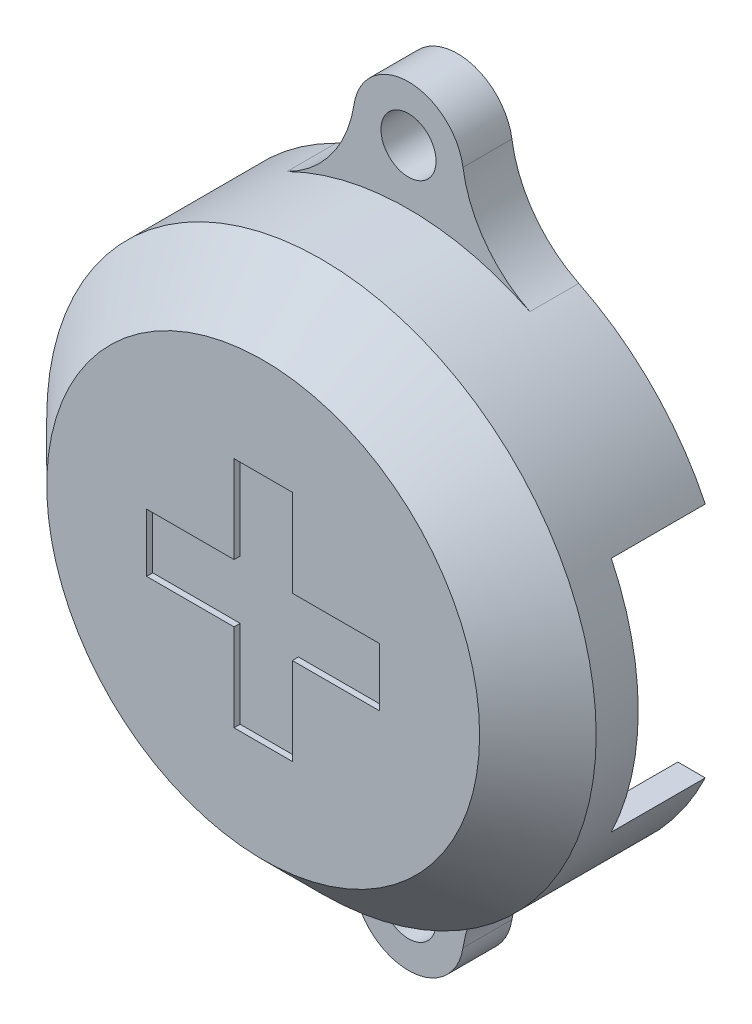
ISO-10303-21;
HEADER;
FILE_DESCRIPTION(('STEP AP214'),'2;1');
FILE_NAME('part.step','',(''),(''),'','','');
FILE_SCHEMA(('AUTOMOTIVE_DESIGN { 1 0 10303 214 1 1 1 1 }'));
ENDSEC;
DATA;
#1=APPLICATION_CONTEXT('core data for automotive mechanical design processes');
#2=APPLICATION_PROTOCOL_DEFINITION('international standard','automotive_design',2000,#1);
#3=PRODUCT_CONTEXT('',#1,'mechanical');
#4=PRODUCT('Part','Part','',(#3));
#5=PRODUCT_RELATED_PRODUCT_CATEGORY('part','',(#4));
#6=PRODUCT_DEFINITION_FORMATION('','',#4);
#7=PRODUCT_DEFINITION_CONTEXT('part definition',#1,'design');
#8=PRODUCT_DEFINITION('design','',#6,#7);
#9=PRODUCT_DEFINITION_SHAPE('','',#8);
#10=(LENGTH_UNIT() NAMED_UNIT(*) SI_UNIT(.MILLI.,.METRE.));
#11=(NAMED_UNIT(*) PLANE_ANGLE_UNIT() SI_UNIT($,.RADIAN.));
#12=(NAMED_UNIT(*) SI_UNIT($,.STERADIAN.) SOLID_ANGLE_UNIT());
#13=UNCERTAINTY_MEASURE_WITH_UNIT(LENGTH_MEASURE(1.E-05),#10,'distance_accuracy_value','');
#14=(GEOMETRIC_REPRESENTATION_CONTEXT(3) GLOBAL_UNCERTAINTY_ASSIGNED_CONTEXT((#13)) GLOBAL_UNIT_ASSIGNED_CONTEXT((#10,
#11,#12)) REPRESENTATION_CONTEXT('',''));
#15=CARTESIAN_POINT('',(0.,0.,0.));
#16=DIRECTION('',(0.,0.,1.));
#17=DIRECTION('',(1.,0.,0.));
#18=AXIS2_PLACEMENT_3D('',#15,#16,#17);
#19=CARTESIAN_POINT('',(0.,0.,0.));
#20=DIRECTION('',(0.,0.,1.));
#21=DIRECTION('',(1.,0.,0.));
#22=AXIS2_PLACEMENT_3D('',#19,#20,#21);
#23=PLANE('',#22);
#24=CARTESIAN_POINT('',(-1.38777878078145E-13,-26.9500000000001,0.));
#25=DIRECTION('',(0.,0.,1.));
#26=DIRECTION('',(1.,0.,0.));
#27=AXIS2_PLACEMENT_3D('',#24,#25,#26);
#28=CIRCLE('',#27,2.25);
#29=CARTESIAN_POINT('',(2.24999999999986,-26.9500000000001,0.));
#30=VERTEX_POINT('',#29);
#31=EDGE_CURVE('E317',#30,#30,#28,.T.);
#32=ORIENTED_EDGE('',*,*,#31,.T.);
#33=EDGE_LOOP('',(#32));
#34=FACE_BOUND('',#33,.T.);
#35=CARTESIAN_POINT('',(3.89761872857662E-13,-2.24526230456904E-11,0.));
#36=DIRECTION('',(0.,0.,1.));
#37=DIRECTION('',(1.,0.,0.));
#38=AXIS2_PLACEMENT_3D('',#35,#36,#37);
#39=CIRCLE('',#38,22.45);
#40=CARTESIAN_POINT('',(-20.2515623828316,-9.68900000282286,0.));
#41=VERTEX_POINT('',#40);
#42=CARTESIAN_POINT('',(-9.9196082532722,-20.139609532027,0.));
#43=VERTEX_POINT('',#42);
#44=EDGE_CURVE('E258',#41,#43,#39,.T.);
#45=ORIENTED_EDGE('',*,*,#44,.F.);
#46=DIRECTION('',(1.,0.,0.));
#47=VECTOR('',#46,1.);
#48=CARTESIAN_POINT('',(-22.4499999999996,-9.68900000282286,0.));
#49=LINE('',#48,#47);
#50=CARTESIAN_POINT('',(-18.0090471415264,-9.68900000282286,0.));
#51=VERTEX_POINT('',#50);
#52=EDGE_CURVE('E747',#41,#51,#49,.T.);
#53=ORIENTED_EDGE('',*,*,#52,.T.);
#54=CARTESIAN_POINT('',(3.89761872857662E-13,-2.24526230456904E-11,0.));
#55=DIRECTION('',(0.,0.,1.));
#56=DIRECTION('',(1.,0.,0.));
#57=AXIS2_PLACEMENT_3D('',#54,#55,#56);
#58=CIRCLE('',#57,20.45);
#59=CARTESIAN_POINT('',(18.0090471415272,-9.68900000282286,0.));
#60=VERTEX_POINT('',#59);
#61=EDGE_CURVE('E305',#51,#60,#58,.T.);
#62=ORIENTED_EDGE('',*,*,#61,.T.);
#63=CARTESIAN_POINT('',(20.2515623828323,-9.68900000282286,0.));
#64=VERTEX_POINT('',#63);
#65=EDGE_CURVE('E745',#60,#64,#49,.T.);
#66=ORIENTED_EDGE('',*,*,#65,.T.);
#67=CARTESIAN_POINT('',(3.89761872857662E-13,-2.24526230456904E-11,0.));
#68=DIRECTION('',(0.,0.,1.));
#69=DIRECTION('',(1.,0.,0.));
#70=AXIS2_PLACEMENT_3D('',#67,#68,#69);
#71=CIRCLE('',#70,22.45);
#72=CARTESIAN_POINT('',(9.91960825327326,-20.1396095320268,0.));
#73=VERTEX_POINT('',#72);
#74=EDGE_CURVE('E354',#73,#64,#71,.T.);
#75=ORIENTED_EDGE('',*,*,#74,.F.);
#76=CARTESIAN_POINT('',(14.3381419963792,-29.1104823747905,0.));
#77=DIRECTION('',(0.,0.,1.));
#78=DIRECTION('',(1.,0.,0.));
#79=AXIS2_PLACEMENT_3D('',#76,#77,#78);
#80=CIRCLE('',#79,10.);
#81=CARTESIAN_POINT('',(4.44976820577325,-27.6204945301229,0.));
#82=VERTEX_POINT('',#81);
#83=EDGE_CURVE('E350',#73,#82,#80,.T.);
#84=ORIENTED_EDGE('',*,*,#83,.T.);
#85=CARTESIAN_POINT('',(5.67110933929236E-13,-26.9500000000225,0.));
#86=DIRECTION('',(0.,0.,1.));
#87=DIRECTION('',(1.,0.,0.));
#88=AXIS2_PLACEMENT_3D('',#85,#86,#87);
#89=CIRCLE('',#88,4.5);
#90=CARTESIAN_POINT('',(-4.44976820577211,-27.6204945301229,0.));
#91=VERTEX_POINT('',#90);
#92=EDGE_CURVE('E347',#91,#82,#89,.T.);
#93=ORIENTED_EDGE('',*,*,#92,.F.);
#94=CARTESIAN_POINT('',(-14.338141996378,-29.1104823747906,0.));
#95=DIRECTION('',(0.,0.,1.));
#96=DIRECTION('',(1.,0.,0.));
#97=AXIS2_PLACEMENT_3D('',#94,#95,#96);
#98=CIRCLE('',#97,9.99999999999999);
#99=EDGE_CURVE('E337',#91,#43,#98,.T.);
#100=ORIENTED_EDGE('',*,*,#99,.T.);
#101=EDGE_LOOP('',(#45,#53,#62,#66,#75,#84,#93,#100));
#102=FACE_BOUND('',#101,.T.);
#103=ADVANCED_FACE('F46',(#34,#102),#23,.F.);
#104=CARTESIAN_POINT('',(0.,0.,15.875));
#105=DIRECTION('',(0.,0.,1.));
#106=DIRECTION('',(1.,0.,0.));
#107=AXIS2_PLACEMENT_3D('',#104,#105,#106);
#108=PLANE('',#107);
#109=CARTESIAN_POINT('',(3.89761872857662E-13,-2.24526230456904E-11,15.875));
#110=DIRECTION('',(0.,0.,1.));
#111=DIRECTION('',(1.,0.,0.));
#112=AXIS2_PLACEMENT_3D('',#109,#110,#111);
#113=CIRCLE('',#112,17.6875);
#114=CARTESIAN_POINT('',(17.6875000000004,-2.24526230456904E-11,15.875));
#115=VERTEX_POINT('',#114);
#116=EDGE_CURVE('E280',#115,#115,#113,.T.);
#117=ORIENTED_EDGE('',*,*,#116,.T.);
#118=EDGE_LOOP('',(#117));
#119=FACE_BOUND('',#118,.T.);
#120=DIRECTION('',(1.,0.,0.));
#121=VECTOR('',#120,1.);
#122=CARTESIAN_POINT('',(0.,9.525,15.875));
#123=LINE('',#122,#121);
#124=CARTESIAN_POINT('',(-2.38125,9.525,15.875));
#125=VERTEX_POINT('',#124);
#126=CARTESIAN_POINT('',(2.38125,9.525,15.875));
#127=VERTEX_POINT('',#126);
#128=EDGE_CURVE('E425',#125,#127,#123,.T.);
#129=ORIENTED_EDGE('',*,*,#128,.T.);
#130=DIRECTION('',(0.,-1.,0.));
#131=VECTOR('',#130,1.);
#132=CARTESIAN_POINT('',(2.38125,0.,15.875));
#133=LINE('',#132,#131);
#134=CARTESIAN_POINT('',(2.38125,2.38125,15.875));
#135=VERTEX_POINT('',#134);
#136=EDGE_CURVE('E389',#127,#135,#133,.T.);
#137=ORIENTED_EDGE('',*,*,#136,.T.);
#138=DIRECTION('',(1.,0.,0.));
#139=VECTOR('',#138,1.);
#140=CARTESIAN_POINT('',(0.,2.38125,15.875));
#141=LINE('',#140,#139);
#142=CARTESIAN_POINT('',(9.525,2.38125,15.875));
#143=VERTEX_POINT('',#142);
#144=EDGE_CURVE('E394',#135,#143,#141,.T.);
#145=ORIENTED_EDGE('',*,*,#144,.T.);
#146=DIRECTION('',(0.,-1.,0.));
#147=VECTOR('',#146,1.);
#148=CARTESIAN_POINT('',(9.525,0.,15.875));
#149=LINE('',#148,#147);
#150=CARTESIAN_POINT('',(9.525,-2.38125,15.875));
#151=VERTEX_POINT('',#150);
#152=EDGE_CURVE('E452',#143,#151,#149,.T.);
#153=ORIENTED_EDGE('',*,*,#152,.T.);
#154=DIRECTION('',(1.,0.,0.));
#155=VECTOR('',#154,1.);
#156=CARTESIAN_POINT('',(0.,-2.38125,15.875));
#157=LINE('',#156,#155);
#158=CARTESIAN_POINT('',(2.38125,-2.38125,15.875));
#159=VERTEX_POINT('',#158);
#160=EDGE_CURVE('E449',#159,#151,#157,.T.);
#161=ORIENTED_EDGE('',*,*,#160,.F.);
#162=DIRECTION('',(0.,-1.,0.));
#163=VECTOR('',#162,1.);
#164=CARTESIAN_POINT('',(2.38125,0.,15.875));
#165=LINE('',#164,#163);
#166=CARTESIAN_POINT('',(2.38125,-9.525,15.875));
#167=VERTEX_POINT('',#166);
#168=EDGE_CURVE('E446',#159,#167,#165,.T.);
#169=ORIENTED_EDGE('',*,*,#168,.T.);
#170=DIRECTION('',(1.,0.,0.));
#171=VECTOR('',#170,1.);
#172=CARTESIAN_POINT('',(0.,-9.525,15.875));
#173=LINE('',#172,#171);
#174=CARTESIAN_POINT('',(-2.38125,-9.525,15.875));
#175=VERTEX_POINT('',#174);
#176=EDGE_CURVE('E443',#175,#167,#173,.T.);
#177=ORIENTED_EDGE('',*,*,#176,.F.);
#178=DIRECTION('',(0.,-1.,0.));
#179=VECTOR('',#178,1.);
#180=CARTESIAN_POINT('',(-2.38125,0.,15.875));
#181=LINE('',#180,#179);
#182=CARTESIAN_POINT('',(-2.38125,-2.38125,15.875));
#183=VERTEX_POINT('',#182);
#184=EDGE_CURVE('E440',#183,#175,#181,.T.);
#185=ORIENTED_EDGE('',*,*,#184,.F.);
#186=DIRECTION('',(1.,0.,0.));
#187=VECTOR('',#186,1.);
#188=CARTESIAN_POINT('',(0.,-2.38125,15.875));
#189=LINE('',#188,#187);
#190=CARTESIAN_POINT('',(-9.525,-2.38125,15.875));
#191=VERTEX_POINT('',#190);
#192=EDGE_CURVE('E437',#191,#183,#189,.T.);
#193=ORIENTED_EDGE('',*,*,#192,.F.);
#194=DIRECTION('',(0.,-1.,0.));
#195=VECTOR('',#194,1.);
#196=CARTESIAN_POINT('',(-9.525,0.,15.875));
#197=LINE('',#196,#195);
#198=CARTESIAN_POINT('',(-9.525,2.38125,15.875));
#199=VERTEX_POINT('',#198);
#200=EDGE_CURVE('E434',#199,#191,#197,.T.);
#201=ORIENTED_EDGE('',*,*,#200,.F.);
#202=DIRECTION('',(1.,0.,0.));
#203=VECTOR('',#202,1.);
#204=CARTESIAN_POINT('',(0.,2.38125,15.875));
#205=LINE('',#204,#203);
#206=CARTESIAN_POINT('',(-2.38125,2.38125,15.875));
#207=VERTEX_POINT('',#206);
#208=EDGE_CURVE('E431',#199,#207,#205,.T.);
#209=ORIENTED_EDGE('',*,*,#208,.T.);
#210=DIRECTION('',(0.,-1.,0.));
#211=VECTOR('',#210,1.);
#212=CARTESIAN_POINT('',(-2.38125,0.,15.875));
#213=LINE('',#212,#211);
#214=EDGE_CURVE('E428',#125,#207,#213,.T.);
#215=ORIENTED_EDGE('',*,*,#214,.F.);
#216=EDGE_LOOP('',(#129,#137,#145,#153,#161,#169,#177,#185,#193,#201,#209,#215));
#217=FACE_BOUND('',#216,.T.);
#218=ADVANCED_FACE('F497',(#119,#217),#108,.T.);
#219=CARTESIAN_POINT('',(20.2515623855119,9.68899999717713,0.));
#220=VERTEX_POINT('',#219);
#221=CARTESIAN_POINT('',(9.91960825327298,20.139609531982,0.));
#222=VERTEX_POINT('',#221);
#223=EDGE_CURVE('E353',#220,#222,#71,.T.);
#224=ORIENTED_EDGE('',*,*,#223,.F.);
#225=DIRECTION('',(1.,0.,0.));
#226=VECTOR('',#225,1.);
#227=CARTESIAN_POINT('',(-22.4499999999996,9.68899999717713,0.));
#228=LINE('',#227,#226);
#229=CARTESIAN_POINT('',(18.0090471445405,9.68899999717713,0.));
#230=VERTEX_POINT('',#229);
#231=EDGE_CURVE('E252',#230,#220,#228,.T.);
#232=ORIENTED_EDGE('',*,*,#231,.F.);
#233=CARTESIAN_POINT('',(-18.0090471445397,9.68899999717713,0.));
#234=VERTEX_POINT('',#233);
#235=EDGE_CURVE('E251',#230,#234,#58,.T.);
#236=ORIENTED_EDGE('',*,*,#235,.T.);
#237=CARTESIAN_POINT('',(-20.2515623855112,9.68899999717713,0.));
#238=VERTEX_POINT('',#237);
#239=EDGE_CURVE('E70',#238,#234,#228,.T.);
#240=ORIENTED_EDGE('',*,*,#239,.F.);
#241=CARTESIAN_POINT('',(-9.91960825327249,20.1396095319819,0.));
#242=VERTEX_POINT('',#241);
#243=EDGE_CURVE('E247',#242,#238,#39,.T.);
#244=ORIENTED_EDGE('',*,*,#243,.F.);
#245=CARTESIAN_POINT('',(-14.3381419963784,29.1104823747455,0.));
#246=DIRECTION('',(0.,0.,1.));
#247=DIRECTION('',(1.,0.,0.));
#248=AXIS2_PLACEMENT_3D('',#245,#246,#247);
#249=CIRCLE('',#248,10.);
#250=CARTESIAN_POINT('',(-4.44976820577248,27.620494530078,0.));
#251=VERTEX_POINT('',#250);
#252=EDGE_CURVE('E262',#242,#251,#249,.T.);
#253=ORIENTED_EDGE('',*,*,#252,.T.);
#254=CARTESIAN_POINT('',(1.99088654611365E-13,26.9499999999776,0.));
#255=DIRECTION('',(0.,0.,1.));
#256=DIRECTION('',(1.,0.,0.));
#257=AXIS2_PLACEMENT_3D('',#254,#255,#256);
#258=CIRCLE('',#257,4.5);
#259=CARTESIAN_POINT('',(4.44976820577287,27.620494530078,0.));
#260=VERTEX_POINT('',#259);
#261=EDGE_CURVE('E359',#260,#251,#258,.T.);
#262=ORIENTED_EDGE('',*,*,#261,.F.);
#263=CARTESIAN_POINT('',(14.3381419963788,29.1104823747457,0.));
#264=DIRECTION('',(0.,0.,1.));
#265=DIRECTION('',(1.,0.,0.));
#266=AXIS2_PLACEMENT_3D('',#263,#264,#265);
#267=CIRCLE('',#266,10.);
#268=EDGE_CURVE('E357',#260,#222,#267,.T.);
#269=ORIENTED_EDGE('',*,*,#268,.T.);
#270=EDGE_LOOP('',(#224,#232,#236,#240,#244,#253,#262,#269));
#271=FACE_BOUND('',#270,.T.);
#272=CARTESIAN_POINT('',(1.99088654611365E-13,26.9499999999776,0.));
#273=DIRECTION('',(0.,0.,1.));
#274=DIRECTION('',(1.,0.,0.));
#275=AXIS2_PLACEMENT_3D('',#272,#273,#274);
#276=CIRCLE('',#275,2.25);
#277=CARTESIAN_POINT('',(2.2500000000002,26.9499999999776,0.));
#278=VERTEX_POINT('',#277);
#279=EDGE_CURVE('E323',#278,#278,#276,.T.);
#280=ORIENTED_EDGE('',*,*,#279,.T.);
#281=EDGE_LOOP('',(#280));
#282=FACE_BOUND('',#281,.T.);
#283=ADVANCED_FACE('F244',(#271,#282),#23,.F.);
#284=CARTESIAN_POINT('',(-14.338141996378,-29.1104823747906,15.875));
#285=DIRECTION('',(0.,0.,-1.));
#286=DIRECTION('',(-1.,0.,0.));
#287=AXIS2_PLACEMENT_3D('',#284,#285,#286);
#288=CYLINDRICAL_SURFACE('',#287,9.99999999999999);
#289=DIRECTION('',(0.,0.,-1.));
#290=VECTOR('',#289,1.);
#291=CARTESIAN_POINT('',(-4.44976820577211,-27.6204945301229,15.875));
#292=LINE('',#291,#290);
#293=CARTESIAN_POINT('',(-4.44976820577211,-27.6204945301229,4.));
#294=VERTEX_POINT('',#293);
#295=EDGE_CURVE('E278',#294,#91,#292,.T.);
#296=ORIENTED_EDGE('',*,*,#295,.F.);
#297=CARTESIAN_POINT('',(-14.338141996378,-29.1104823747906,4.));
#298=DIRECTION('',(0.,0.,1.));
#299=DIRECTION('',(1.,0.,0.));
#300=AXIS2_PLACEMENT_3D('',#297,#298,#299);
#301=CIRCLE('',#300,9.99999999999999);
#302=CARTESIAN_POINT('',(-9.9196082532722,-20.139609532027,4.));
#303=VERTEX_POINT('',#302);
#304=EDGE_CURVE('E329',#303,#294,#301,.F.);
#305=ORIENTED_EDGE('',*,*,#304,.F.);
#306=DIRECTION('',(0.,0.,-1.));
#307=VECTOR('',#306,1.);
#308=CARTESIAN_POINT('',(-9.9196082532722,-20.139609532027,15.875));
#309=LINE('',#308,#307);
#310=EDGE_CURVE('E257',#303,#43,#309,.T.);
#311=ORIENTED_EDGE('',*,*,#310,.T.);
#312=ORIENTED_EDGE('',*,*,#99,.F.);
#313=EDGE_LOOP('',(#296,#305,#311,#312));
#314=FACE_BOUND('',#313,.T.);
#315=ADVANCED_FACE('F508',(#314),#288,.F.);
#316=CARTESIAN_POINT('',(5.67110933929236E-13,-26.9500000000225,15.875));
#317=DIRECTION('',(0.,0.,-1.));
#318=DIRECTION('',(-1.,0.,0.));
#319=AXIS2_PLACEMENT_3D('',#316,#317,#318);
#320=CYLINDRICAL_SURFACE('',#319,4.5);
#321=CARTESIAN_POINT('',(5.67110933929236E-13,-26.9500000000225,4.));
#322=DIRECTION('',(0.,0.,1.));
#323=DIRECTION('',(1.,0.,0.));
#324=AXIS2_PLACEMENT_3D('',#321,#322,#323);
#325=CIRCLE('',#324,4.5);
#326=CARTESIAN_POINT('',(4.44976820577325,-27.6204945301229,4.));
#327=VERTEX_POINT('',#326);
#328=EDGE_CURVE('E332',#294,#327,#325,.T.);
#329=ORIENTED_EDGE('',*,*,#328,.F.);
#330=ORIENTED_EDGE('',*,*,#295,.T.);
#331=ORIENTED_EDGE('',*,*,#92,.T.);
#332=DIRECTION('',(0.,0.,-1.));
#333=VECTOR('',#332,1.);
#334=CARTESIAN_POINT('',(4.44976820577325,-27.6204945301229,15.875));
#335=LINE('',#334,#333);
#336=EDGE_CURVE('E276',#327,#82,#335,.T.);
#337=ORIENTED_EDGE('',*,*,#336,.F.);
#338=EDGE_LOOP('',(#329,#330,#331,#337));
#339=FACE_BOUND('',#338,.T.);
#340=ADVANCED_FACE('F512',(#339),#320,.T.);
#341=CARTESIAN_POINT('',(14.3381419963792,-29.1104823747905,15.875));
#342=DIRECTION('',(0.,0.,-1.));
#343=DIRECTION('',(-1.,0.,0.));
#344=AXIS2_PLACEMENT_3D('',#341,#342,#343);
#345=CYLINDRICAL_SURFACE('',#344,10.);
#346=DIRECTION('',(0.,0.,-1.));
#347=VECTOR('',#346,1.);
#348=CARTESIAN_POINT('',(9.91960825327326,-20.1396095320268,15.875));
#349=LINE('',#348,#347);
#350=CARTESIAN_POINT('',(9.91960825327324,-20.1396095320268,4.));
#351=VERTEX_POINT('',#350);
#352=EDGE_CURVE('E274',#351,#73,#349,.T.);
#353=ORIENTED_EDGE('',*,*,#352,.F.);
#354=CARTESIAN_POINT('',(14.3381419963792,-29.1104823747905,4.));
#355=DIRECTION('',(0.,0.,1.));
#356=DIRECTION('',(1.,0.,0.));
#357=AXIS2_PLACEMENT_3D('',#354,#355,#356);
#358=CIRCLE('',#357,10.);
#359=EDGE_CURVE('E334',#327,#351,#358,.F.);
#360=ORIENTED_EDGE('',*,*,#359,.F.);
#361=ORIENTED_EDGE('',*,*,#336,.T.);
#362=ORIENTED_EDGE('',*,*,#83,.F.);
#363=EDGE_LOOP('',(#353,#360,#361,#362));
#364=FACE_BOUND('',#363,.T.);
#365=ADVANCED_FACE('F517',(#364),#345,.F.);
#366=CARTESIAN_POINT('',(14.3381419963788,29.1104823747457,15.875));
#367=DIRECTION('',(0.,0.,-1.));
#368=DIRECTION('',(-1.,0.,0.));
#369=AXIS2_PLACEMENT_3D('',#366,#367,#368);
#370=CYLINDRICAL_SURFACE('',#369,10.);
#371=DIRECTION('',(0.,0.,-1.));
#372=VECTOR('',#371,1.);
#373=CARTESIAN_POINT('',(4.44976820577287,27.620494530078,15.875));
#374=LINE('',#373,#372);
#375=CARTESIAN_POINT('',(4.44976820577287,27.620494530078,4.));
#376=VERTEX_POINT('',#375);
#377=EDGE_CURVE('E269',#376,#260,#374,.T.);
#378=ORIENTED_EDGE('',*,*,#377,.F.);
#379=CARTESIAN_POINT('',(14.3381419963788,29.1104823747457,4.));
#380=DIRECTION('',(0.,0.,1.));
#381=DIRECTION('',(1.,0.,0.));
#382=AXIS2_PLACEMENT_3D('',#379,#380,#381);
#383=CIRCLE('',#382,10.);
#384=CARTESIAN_POINT('',(9.91960825327298,20.139609531982,4.));
#385=VERTEX_POINT('',#384);
#386=EDGE_CURVE('E339',#385,#376,#383,.F.);
#387=ORIENTED_EDGE('',*,*,#386,.F.);
#388=DIRECTION('',(0.,0.,-1.));
#389=VECTOR('',#388,1.);
#390=CARTESIAN_POINT('',(9.91960825327298,20.139609531982,15.875));
#391=LINE('',#390,#389);
#392=EDGE_CURVE('E271',#385,#222,#391,.T.);
#393=ORIENTED_EDGE('',*,*,#392,.T.);
#394=ORIENTED_EDGE('',*,*,#268,.F.);
#395=EDGE_LOOP('',(#378,#387,#393,#394));
#396=FACE_BOUND('',#395,.T.);
#397=ADVANCED_FACE('F374',(#396),#370,.F.);
#398=CARTESIAN_POINT('',(1.99088654611365E-13,26.9499999999776,15.875));
#399=DIRECTION('',(0.,0.,-1.));
#400=DIRECTION('',(-1.,0.,0.));
#401=AXIS2_PLACEMENT_3D('',#398,#399,#400);
#402=CYLINDRICAL_SURFACE('',#401,4.5);
#403=CARTESIAN_POINT('',(1.99088654611365E-13,26.9499999999776,4.));
#404=DIRECTION('',(0.,0.,1.));
#405=DIRECTION('',(1.,0.,0.));
#406=AXIS2_PLACEMENT_3D('',#403,#404,#405);
#407=CIRCLE('',#406,4.5);
#408=CARTESIAN_POINT('',(-4.44976820577248,27.620494530078,4.));
#409=VERTEX_POINT('',#408);
#410=EDGE_CURVE('E341',#376,#409,#407,.T.);
#411=ORIENTED_EDGE('',*,*,#410,.F.);
#412=ORIENTED_EDGE('',*,*,#377,.T.);
#413=ORIENTED_EDGE('',*,*,#261,.T.);
#414=DIRECTION('',(0.,0.,-1.));
#415=VECTOR('',#414,1.);
#416=CARTESIAN_POINT('',(-4.44976820577248,27.620494530078,15.875));
#417=LINE('',#416,#415);
#418=EDGE_CURVE('E267',#409,#251,#417,.T.);
#419=ORIENTED_EDGE('',*,*,#418,.F.);
#420=EDGE_LOOP('',(#411,#412,#413,#419));
#421=FACE_BOUND('',#420,.T.);
#422=ADVANCED_FACE('F369',(#421),#402,.T.);
#423=CARTESIAN_POINT('',(-14.3381419963784,29.1104823747455,15.875));
#424=DIRECTION('',(0.,0.,-1.));
#425=DIRECTION('',(-1.,0.,0.));
#426=AXIS2_PLACEMENT_3D('',#423,#424,#425);
#427=CYLINDRICAL_SURFACE('',#426,10.);
#428=DIRECTION('',(0.,0.,-1.));
#429=VECTOR('',#428,1.);
#430=CARTESIAN_POINT('',(-9.91960825327249,20.1396095319819,15.875));
#431=LINE('',#430,#429);
#432=CARTESIAN_POINT('',(-9.91960825327248,20.1396095319819,4.));
#433=VERTEX_POINT('',#432);
#434=EDGE_CURVE('E256',#433,#242,#431,.T.);
#435=ORIENTED_EDGE('',*,*,#434,.F.);
#436=CARTESIAN_POINT('',(-14.3381419963784,29.1104823747455,4.));
#437=DIRECTION('',(0.,0.,1.));
#438=DIRECTION('',(1.,0.,0.));
#439=AXIS2_PLACEMENT_3D('',#436,#437,#438);
#440=CIRCLE('',#439,10.);
#441=EDGE_CURVE('E330',#409,#433,#440,.F.);
#442=ORIENTED_EDGE('',*,*,#441,.F.);
#443=ORIENTED_EDGE('',*,*,#418,.T.);
#444=ORIENTED_EDGE('',*,*,#252,.F.);
#445=EDGE_LOOP('',(#435,#442,#443,#444));
#446=FACE_BOUND('',#445,.T.);
#447=ADVANCED_FACE('F366',(#446),#427,.F.);
#448=CARTESIAN_POINT('',(3.89761872857662E-13,-2.24526230456904E-11,15.875));
#449=DIRECTION('',(0.,0.,-1.));
#450=DIRECTION('',(-1.,0.,0.));
#451=AXIS2_PLACEMENT_3D('',#448,#449,#450);
#452=CYLINDRICAL_SURFACE('',#451,22.45);
#453=CARTESIAN_POINT('',(3.89761872857662E-13,-2.24526230456904E-11,11.1125));
#454=DIRECTION('',(0.,0.,1.));
#455=DIRECTION('',(1.,0.,0.));
#456=AXIS2_PLACEMENT_3D('',#453,#454,#455);
#457=CIRCLE('',#456,22.45);
#458=CARTESIAN_POINT('',(22.4500000000004,-2.24526230456904E-11,11.1125));
#459=VERTEX_POINT('',#458);
#460=EDGE_CURVE('E283',#459,#459,#457,.F.);
#461=ORIENTED_EDGE('',*,*,#460,.T.);
#462=EDGE_LOOP('',(#461));
#463=FACE_BOUND('',#462,.T.);
#464=CARTESIAN_POINT('',(3.89761872857662E-13,-2.24526230456904E-11,7.67680000000135));
#465=DIRECTION('',(0.,0.,1.));
#466=DIRECTION('',(1.,0.,0.));
#467=AXIS2_PLACEMENT_3D('',#464,#465,#466);
#468=CIRCLE('',#467,22.45);
#469=CARTESIAN_POINT('',(20.2515623828323,-9.68900000282286,7.67680000000135));
#470=VERTEX_POINT('',#469);
#471=CARTESIAN_POINT('',(20.2515623855119,9.68899999717713,7.67680000000135));
#472=VERTEX_POINT('',#471);
#473=EDGE_CURVE('E378',#470,#472,#468,.T.);
#474=ORIENTED_EDGE('',*,*,#473,.T.);
#475=DIRECTION('',(0.,0.,-1.));
#476=VECTOR('',#475,1.);
#477=CARTESIAN_POINT('',(20.2515623855119,9.68899999717713,15.875));
#478=LINE('',#477,#476);
#479=EDGE_CURVE('E237',#472,#220,#478,.T.);
#480=ORIENTED_EDGE('',*,*,#479,.T.);
#481=ORIENTED_EDGE('',*,*,#223,.T.);
#482=ORIENTED_EDGE('',*,*,#392,.F.);
#483=CARTESIAN_POINT('',(3.89761872857662E-13,-2.24526230456904E-11,4.));
#484=DIRECTION('',(0.,0.,1.));
#485=DIRECTION('',(1.,0.,0.));
#486=AXIS2_PLACEMENT_3D('',#483,#484,#485);
#487=CIRCLE('',#486,22.45);
#488=EDGE_CURVE('E326',#385,#433,#487,.T.);
#489=ORIENTED_EDGE('',*,*,#488,.T.);
#490=ORIENTED_EDGE('',*,*,#434,.T.);
#491=ORIENTED_EDGE('',*,*,#243,.T.);
#492=DIRECTION('',(0.,0.,-1.));
#493=VECTOR('',#492,1.);
#494=CARTESIAN_POINT('',(-20.2515623855112,9.68899999717713,15.875));
#495=LINE('',#494,#493);
#496=CARTESIAN_POINT('',(-20.2515623855112,9.68899999717713,7.67680000000135));
#497=VERTEX_POINT('',#496);
#498=EDGE_CURVE('E231',#238,#497,#495,.F.);
#499=ORIENTED_EDGE('',*,*,#498,.T.);
#500=CARTESIAN_POINT('',(-20.2515623828316,-9.68900000282286,7.67680000000135));
#501=VERTEX_POINT('',#500);
#502=EDGE_CURVE('E380',#497,#501,#468,.T.);
#503=ORIENTED_EDGE('',*,*,#502,.T.);
#504=DIRECTION('',(0.,0.,-1.));
#505=VECTOR('',#504,1.);
#506=CARTESIAN_POINT('',(-20.2515623828316,-9.68900000282287,15.875));
#507=LINE('',#506,#505);
#508=EDGE_CURVE('E386',#501,#41,#507,.T.);
#509=ORIENTED_EDGE('',*,*,#508,.T.);
#510=ORIENTED_EDGE('',*,*,#44,.T.);
#511=ORIENTED_EDGE('',*,*,#310,.F.);
#512=CARTESIAN_POINT('',(3.89761872857662E-13,-2.24526230456904E-11,4.));
#513=DIRECTION('',(0.,0.,1.));
#514=DIRECTION('',(1.,0.,0.));
#515=AXIS2_PLACEMENT_3D('',#512,#513,#514);
#516=CIRCLE('',#515,22.45);
#517=EDGE_CURVE('E327',#303,#351,#516,.T.);
#518=ORIENTED_EDGE('',*,*,#517,.T.);
#519=ORIENTED_EDGE('',*,*,#352,.T.);
#520=ORIENTED_EDGE('',*,*,#74,.T.);
#521=DIRECTION('',(0.,0.,-1.));
#522=VECTOR('',#521,1.);
#523=CARTESIAN_POINT('',(20.2515623828323,-9.68900000282287,15.875));
#524=LINE('',#523,#522);
#525=EDGE_CURVE('E384',#64,#470,#524,.F.);
#526=ORIENTED_EDGE('',*,*,#525,.T.);
#527=EDGE_LOOP('',(#474,#480,#481,#482,#489,#490,#491,#499,#503,#509,#510,#511,#518,#519,#520,#526));
#528=FACE_BOUND('',#527,.T.);
#529=ADVANCED_FACE('F254',(#463,#528),#452,.T.);
#530=CARTESIAN_POINT('',(0.,0.,4.));
#531=DIRECTION('',(0.,0.,1.));
#532=DIRECTION('',(1.,0.,0.));
#533=AXIS2_PLACEMENT_3D('',#530,#531,#532);
#534=PLANE('',#533);
#535=CARTESIAN_POINT('',(1.99088654611365E-13,26.9499999999776,4.));
#536=DIRECTION('',(0.,0.,1.));
#537=DIRECTION('',(1.,0.,0.));
#538=AXIS2_PLACEMENT_3D('',#535,#536,#537);
#539=CIRCLE('',#538,2.24999999999999);
#540=CARTESIAN_POINT('',(2.25000000000019,26.9499999999776,4.));
#541=VERTEX_POINT('',#540);
#542=EDGE_CURVE('E320',#541,#541,#539,.T.);
#543=ORIENTED_EDGE('',*,*,#542,.F.);
#544=EDGE_LOOP('',(#543));
#545=FACE_BOUND('',#544,.T.);
#546=ORIENTED_EDGE('',*,*,#488,.F.);
#547=ORIENTED_EDGE('',*,*,#386,.T.);
#548=ORIENTED_EDGE('',*,*,#410,.T.);
#549=ORIENTED_EDGE('',*,*,#441,.T.);
#550=EDGE_LOOP('',(#546,#547,#548,#549));
#551=FACE_BOUND('',#550,.T.);
#552=ADVANCED_FACE('F531',(#545,#551),#534,.T.);
#553=CARTESIAN_POINT('',(0.,0.,4.));
#554=DIRECTION('',(0.,0.,1.));
#555=DIRECTION('',(1.,0.,0.));
#556=AXIS2_PLACEMENT_3D('',#553,#554,#555);
#557=PLANE('',#556);
#558=CARTESIAN_POINT('',(-1.38777878078145E-13,-26.9500000000001,4.));
#559=DIRECTION('',(0.,0.,1.));
#560=DIRECTION('',(1.,0.,0.));
#561=AXIS2_PLACEMENT_3D('',#558,#559,#560);
#562=CIRCLE('',#561,2.24999999999999);
#563=CARTESIAN_POINT('',(2.24999999999985,-26.9500000000001,4.));
#564=VERTEX_POINT('',#563);
#565=EDGE_CURVE('E314',#564,#564,#562,.T.);
#566=ORIENTED_EDGE('',*,*,#565,.F.);
#567=EDGE_LOOP('',(#566));
#568=FACE_BOUND('',#567,.T.);
#569=ORIENTED_EDGE('',*,*,#517,.F.);
#570=ORIENTED_EDGE('',*,*,#304,.T.);
#571=ORIENTED_EDGE('',*,*,#328,.T.);
#572=ORIENTED_EDGE('',*,*,#359,.T.);
#573=EDGE_LOOP('',(#569,#570,#571,#572));
#574=FACE_BOUND('',#573,.T.);
#575=ADVANCED_FACE('F536',(#568,#574),#557,.T.);
#576=CARTESIAN_POINT('',(1.99088654611365E-13,26.9499999999776,4.));
#577=DIRECTION('',(0.,0.,1.));
#578=DIRECTION('',(1.,0.,0.));
#579=AXIS2_PLACEMENT_3D('',#576,#577,#578);
#580=CYLINDRICAL_SURFACE('',#579,2.24999999999999);
#581=ORIENTED_EDGE('',*,*,#279,.F.);
#582=EDGE_LOOP('',(#581));
#583=FACE_BOUND('',#582,.T.);
#584=ORIENTED_EDGE('',*,*,#542,.T.);
#585=EDGE_LOOP('',(#584));
#586=FACE_BOUND('',#585,.T.);
#587=ADVANCED_FACE('F768',(#583,#586),#580,.F.);
#588=CARTESIAN_POINT('',(-1.38777878078145E-13,-26.9500000000001,4.));
#589=DIRECTION('',(0.,0.,1.));
#590=DIRECTION('',(1.,0.,0.));
#591=AXIS2_PLACEMENT_3D('',#588,#589,#590);
#592=CYLINDRICAL_SURFACE('',#591,2.24999999999999);
#593=ORIENTED_EDGE('',*,*,#31,.F.);
#594=EDGE_LOOP('',(#593));
#595=FACE_BOUND('',#594,.T.);
#596=ORIENTED_EDGE('',*,*,#565,.T.);
#597=EDGE_LOOP('',(#596));
#598=FACE_BOUND('',#597,.T.);
#599=ADVANCED_FACE('F543',(#595,#598),#592,.F.);
#600=CARTESIAN_POINT('',(3.89761872857662E-13,-2.24526230456904E-11,15.875));
#601=DIRECTION('',(0.,0.,-1.));
#602=DIRECTION('',(-1.,0.,0.));
#603=AXIS2_PLACEMENT_3D('',#600,#601,#602);
#604=CONICAL_SURFACE('',#603,17.6875,0.785398163397447);
#605=ORIENTED_EDGE('',*,*,#460,.F.);
#606=EDGE_LOOP('',(#605));
#607=FACE_BOUND('',#606,.T.);
#608=ORIENTED_EDGE('',*,*,#116,.F.);
#609=EDGE_LOOP('',(#608));
#610=FACE_BOUND('',#609,.T.);
#611=ADVANCED_FACE('F49',(#607,#610),#604,.T.);
#612=CARTESIAN_POINT('',(0.,0.,13.875));
#613=DIRECTION('',(0.,0.,1.));
#614=DIRECTION('',(1.,0.,0.));
#615=AXIS2_PLACEMENT_3D('',#612,#613,#614);
#616=PLANE('',#615);
#617=CARTESIAN_POINT('',(3.89761872857662E-13,-2.24526230456904E-11,13.875));
#618=DIRECTION('',(0.,0.,1.));
#619=DIRECTION('',(1.,0.,0.));
#620=AXIS2_PLACEMENT_3D('',#617,#618,#619);
#621=CIRCLE('',#620,16.8590728752538);
#622=CARTESIAN_POINT('',(16.8590728752542,-2.24526230456904E-11,13.875));
#623=VERTEX_POINT('',#622);
#624=EDGE_CURVE('E304',#623,#623,#621,.T.);
#625=ORIENTED_EDGE('',*,*,#624,.F.);
#626=EDGE_LOOP('',(#625));
#627=FACE_BOUND('',#626,.T.);
#628=ADVANCED_FACE('F486',(#627),#616,.F.);
#629=CARTESIAN_POINT('',(3.89761872857662E-13,-2.24526230456904E-11,15.875));
#630=DIRECTION('',(0.,0.,-1.));
#631=DIRECTION('',(-1.,0.,0.));
#632=AXIS2_PLACEMENT_3D('',#629,#630,#631);
#633=CYLINDRICAL_SURFACE('',#632,20.45);
#634=DIRECTION('',(0.,0.,-1.));
#635=VECTOR('',#634,1.);
#636=CARTESIAN_POINT('',(18.0090471415272,-9.68900000282287,15.875));
#637=LINE('',#636,#635);
#638=CARTESIAN_POINT('',(18.0090471415272,-9.68900000282286,7.67680000000135));
#639=VERTEX_POINT('',#638);
#640=EDGE_CURVE('E11',#60,#639,#637,.F.);
#641=ORIENTED_EDGE('',*,*,#640,.F.);
#642=ORIENTED_EDGE('',*,*,#61,.F.);
#643=DIRECTION('',(0.,0.,-1.));
#644=VECTOR('',#643,1.);
#645=CARTESIAN_POINT('',(-18.0090471415264,-9.68900000282287,15.875));
#646=LINE('',#645,#644);
#647=CARTESIAN_POINT('',(-18.0090471415264,-9.68900000282286,7.67680000000135));
#648=VERTEX_POINT('',#647);
#649=EDGE_CURVE('E290',#648,#51,#646,.T.);
#650=ORIENTED_EDGE('',*,*,#649,.F.);
#651=CARTESIAN_POINT('',(3.89761872857662E-13,-2.24526230456904E-11,7.67680000000135));
#652=DIRECTION('',(0.,0.,1.));
#653=DIRECTION('',(1.,0.,0.));
#654=AXIS2_PLACEMENT_3D('',#651,#652,#653);
#655=CIRCLE('',#654,20.45);
#656=CARTESIAN_POINT('',(-18.0090471445397,9.68899999717713,7.67680000000135));
#657=VERTEX_POINT('',#656);
#658=EDGE_CURVE('E288',#657,#648,#655,.T.);
#659=ORIENTED_EDGE('',*,*,#658,.F.);
#660=DIRECTION('',(0.,0.,-1.));
#661=VECTOR('',#660,1.);
#662=CARTESIAN_POINT('',(-18.0090471445397,9.68899999717713,15.875));
#663=LINE('',#662,#661);
#664=EDGE_CURVE('E286',#234,#657,#663,.F.);
#665=ORIENTED_EDGE('',*,*,#664,.F.);
#666=ORIENTED_EDGE('',*,*,#235,.F.);
#667=DIRECTION('',(0.,0.,-1.));
#668=VECTOR('',#667,1.);
#669=CARTESIAN_POINT('',(18.0090471445405,9.68899999717713,15.875));
#670=LINE('',#669,#668);
#671=CARTESIAN_POINT('',(18.0090471445405,9.68899999717713,7.67680000000135));
#672=VERTEX_POINT('',#671);
#673=EDGE_CURVE('E291',#672,#230,#670,.T.);
#674=ORIENTED_EDGE('',*,*,#673,.F.);
#675=EDGE_CURVE('E55',#639,#672,#655,.T.);
#676=ORIENTED_EDGE('',*,*,#675,.F.);
#677=EDGE_LOOP('',(#641,#642,#650,#659,#665,#666,#674,#676));
#678=FACE_BOUND('',#677,.T.);
#679=CARTESIAN_POINT('',(3.89761872857662E-13,-2.24526230456904E-11,10.2840728752538));
#680=DIRECTION('',(0.,0.,-1.));
#681=DIRECTION('',(-1.,0.,0.));
#682=AXIS2_PLACEMENT_3D('',#679,#680,#681);
#683=CIRCLE('',#682,20.45);
#684=CARTESIAN_POINT('',(-20.4499999999996,-2.24526230456904E-11,10.2840728752538));
#685=VERTEX_POINT('',#684);
#686=EDGE_CURVE('E308',#685,#685,#683,.T.);
#687=ORIENTED_EDGE('',*,*,#686,.F.);
#688=EDGE_LOOP('',(#687));
#689=FACE_BOUND('',#688,.T.);
#690=ADVANCED_FACE('F301',(#678,#689),#633,.F.);
#691=CARTESIAN_POINT('',(3.89761872857662E-13,-2.24526230456904E-11,14.4607864376269));
#692=DIRECTION('',(0.,0.,-1.));
#693=DIRECTION('',(-1.,0.,0.));
#694=AXIS2_PLACEMENT_3D('',#691,#692,#693);
#695=CONICAL_SURFACE('',#694,16.2732864376269,0.785398163397447);
#696=ORIENTED_EDGE('',*,*,#686,.T.);
#697=EDGE_LOOP('',(#696));
#698=FACE_BOUND('',#697,.T.);
#699=ORIENTED_EDGE('',*,*,#624,.T.);
#700=EDGE_LOOP('',(#699));
#701=FACE_BOUND('',#700,.T.);
#702=ADVANCED_FACE('F483',(#698,#701),#695,.F.);
#703=CARTESIAN_POINT('',(2.38125,0.,15.375));
#704=DIRECTION('',(-1.,0.,0.));
#705=DIRECTION('',(0.,-1.,0.));
#706=AXIS2_PLACEMENT_3D('',#703,#704,#705);
#707=PLANE('',#706);
#708=ORIENTED_EDGE('',*,*,#136,.F.);
#709=DIRECTION('',(0.,0.,1.));
#710=VECTOR('',#709,1.);
#711=CARTESIAN_POINT('',(2.38125,9.525,15.375));
#712=LINE('',#711,#710);
#713=CARTESIAN_POINT('',(2.38125,9.525,15.375));
#714=VERTEX_POINT('',#713);
#715=EDGE_CURVE('E422',#714,#127,#712,.T.);
#716=ORIENTED_EDGE('',*,*,#715,.F.);
#717=DIRECTION('',(0.,-1.,0.));
#718=VECTOR('',#717,1.);
#719=CARTESIAN_POINT('',(2.38125,0.,15.375));
#720=LINE('',#719,#718);
#721=CARTESIAN_POINT('',(2.38125,2.38125,15.375));
#722=VERTEX_POINT('',#721);
#723=EDGE_CURVE('E390',#714,#722,#720,.T.);
#724=ORIENTED_EDGE('',*,*,#723,.T.);
#725=DIRECTION('',(0.,0.,1.));
#726=VECTOR('',#725,1.);
#727=CARTESIAN_POINT('',(2.38125,2.38125,15.375));
#728=LINE('',#727,#726);
#729=EDGE_CURVE('E311',#722,#135,#728,.T.);
#730=ORIENTED_EDGE('',*,*,#729,.T.);
#731=EDGE_LOOP('',(#708,#716,#724,#730));
#732=FACE_BOUND('',#731,.T.);
#733=ADVANCED_FACE('F492',(#732),#707,.T.);
#734=CARTESIAN_POINT('',(0.,2.38125,15.375));
#735=DIRECTION('',(0.,-1.,0.));
#736=DIRECTION('',(0.,0.,-1.));
#737=AXIS2_PLACEMENT_3D('',#734,#735,#736);
#738=PLANE('',#737);
#739=ORIENTED_EDGE('',*,*,#144,.F.);
#740=ORIENTED_EDGE('',*,*,#729,.F.);
#741=DIRECTION('',(1.,0.,0.));
#742=VECTOR('',#741,1.);
#743=CARTESIAN_POINT('',(0.,2.38125,15.375));
#744=LINE('',#743,#742);
#745=CARTESIAN_POINT('',(9.525,2.38125,15.375));
#746=VERTEX_POINT('',#745);
#747=EDGE_CURVE('E420',#722,#746,#744,.T.);
#748=ORIENTED_EDGE('',*,*,#747,.T.);
#749=DIRECTION('',(0.,0.,1.));
#750=VECTOR('',#749,1.);
#751=CARTESIAN_POINT('',(9.525,2.38125,15.375));
#752=LINE('',#751,#750);
#753=EDGE_CURVE('E459',#746,#143,#752,.T.);
#754=ORIENTED_EDGE('',*,*,#753,.T.);
#755=EDGE_LOOP('',(#739,#740,#748,#754));
#756=FACE_BOUND('',#755,.T.);
#757=ADVANCED_FACE('F561',(#756),#738,.T.);
#758=CARTESIAN_POINT('',(9.525,0.,15.375));
#759=DIRECTION('',(-1.,0.,0.));
#760=DIRECTION('',(0.,0.,1.));
#761=AXIS2_PLACEMENT_3D('',#758,#759,#760);
#762=PLANE('',#761);
#763=ORIENTED_EDGE('',*,*,#152,.F.);
#764=ORIENTED_EDGE('',*,*,#753,.F.);
#765=DIRECTION('',(0.,-1.,0.));
#766=VECTOR('',#765,1.);
#767=CARTESIAN_POINT('',(9.525,0.,15.375));
#768=LINE('',#767,#766);
#769=CARTESIAN_POINT('',(9.525,-2.38125,15.375));
#770=VERTEX_POINT('',#769);
#771=EDGE_CURVE('E418',#746,#770,#768,.T.);
#772=ORIENTED_EDGE('',*,*,#771,.T.);
#773=DIRECTION('',(0.,0.,1.));
#774=VECTOR('',#773,1.);
#775=CARTESIAN_POINT('',(9.525,-2.38125,15.375));
#776=LINE('',#775,#774);
#777=EDGE_CURVE('E461',#770,#151,#776,.T.);
#778=ORIENTED_EDGE('',*,*,#777,.T.);
#779=EDGE_LOOP('',(#763,#764,#772,#778));
#780=FACE_BOUND('',#779,.T.);
#781=ADVANCED_FACE('F564',(#780),#762,.T.);
#782=CARTESIAN_POINT('',(0.,-2.38125,15.375));
#783=DIRECTION('',(0.,-1.,0.));
#784=DIRECTION('',(1.,0.,0.));
#785=AXIS2_PLACEMENT_3D('',#782,#783,#784);
#786=PLANE('',#785);
#787=ORIENTED_EDGE('',*,*,#160,.T.);
#788=ORIENTED_EDGE('',*,*,#777,.F.);
#789=DIRECTION('',(1.,0.,0.));
#790=VECTOR('',#789,1.);
#791=CARTESIAN_POINT('',(0.,-2.38125,15.375));
#792=LINE('',#791,#790);
#793=CARTESIAN_POINT('',(2.38125,-2.38125,15.375));
#794=VERTEX_POINT('',#793);
#795=EDGE_CURVE('E415',#794,#770,#792,.T.);
#796=ORIENTED_EDGE('',*,*,#795,.F.);
#797=DIRECTION('',(0.,0.,1.));
#798=VECTOR('',#797,1.);
#799=CARTESIAN_POINT('',(2.38125,-2.38125,15.375));
#800=LINE('',#799,#798);
#801=EDGE_CURVE('E463',#794,#159,#800,.T.);
#802=ORIENTED_EDGE('',*,*,#801,.T.);
#803=EDGE_LOOP('',(#787,#788,#796,#802));
#804=FACE_BOUND('',#803,.T.);
#805=ADVANCED_FACE('F570',(#804),#786,.F.);
#806=CARTESIAN_POINT('',(2.38125,0.,15.375));
#807=DIRECTION('',(-1.,0.,0.));
#808=DIRECTION('',(0.,-1.,0.));
#809=AXIS2_PLACEMENT_3D('',#806,#807,#808);
#810=PLANE('',#809);
#811=ORIENTED_EDGE('',*,*,#168,.F.);
#812=ORIENTED_EDGE('',*,*,#801,.F.);
#813=DIRECTION('',(0.,-1.,0.));
#814=VECTOR('',#813,1.);
#815=CARTESIAN_POINT('',(2.38125,0.,15.375));
#816=LINE('',#815,#814);
#817=CARTESIAN_POINT('',(2.38125,-9.525,15.375));
#818=VERTEX_POINT('',#817);
#819=EDGE_CURVE('E413',#794,#818,#816,.T.);
#820=ORIENTED_EDGE('',*,*,#819,.T.);
#821=DIRECTION('',(0.,0.,1.));
#822=VECTOR('',#821,1.);
#823=CARTESIAN_POINT('',(2.38125,-9.525,15.375));
#824=LINE('',#823,#822);
#825=EDGE_CURVE('E465',#818,#167,#824,.T.);
#826=ORIENTED_EDGE('',*,*,#825,.T.);
#827=EDGE_LOOP('',(#811,#812,#820,#826));
#828=FACE_BOUND('',#827,.T.);
#829=ADVANCED_FACE('F574',(#828),#810,.T.);
#830=CARTESIAN_POINT('',(0.,-9.525,15.375));
#831=DIRECTION('',(0.,-1.,0.));
#832=DIRECTION('',(0.,0.,-1.));
#833=AXIS2_PLACEMENT_3D('',#830,#831,#832);
#834=PLANE('',#833);
#835=ORIENTED_EDGE('',*,*,#176,.T.);
#836=ORIENTED_EDGE('',*,*,#825,.F.);
#837=DIRECTION('',(1.,0.,0.));
#838=VECTOR('',#837,1.);
#839=CARTESIAN_POINT('',(0.,-9.525,15.375));
#840=LINE('',#839,#838);
#841=CARTESIAN_POINT('',(-2.38125,-9.525,15.375));
#842=VERTEX_POINT('',#841);
#843=EDGE_CURVE('E410',#842,#818,#840,.T.);
#844=ORIENTED_EDGE('',*,*,#843,.F.);
#845=DIRECTION('',(0.,0.,1.));
#846=VECTOR('',#845,1.);
#847=CARTESIAN_POINT('',(-2.38125,-9.525,15.375));
#848=LINE('',#847,#846);
#849=EDGE_CURVE('E467',#842,#175,#848,.T.);
#850=ORIENTED_EDGE('',*,*,#849,.T.);
#851=EDGE_LOOP('',(#835,#836,#844,#850));
#852=FACE_BOUND('',#851,.T.);
#853=ADVANCED_FACE('F578',(#852),#834,.F.);
#854=CARTESIAN_POINT('',(-2.38125,0.,15.375));
#855=DIRECTION('',(-1.,0.,0.));
#856=DIRECTION('',(0.,-1.,0.));
#857=AXIS2_PLACEMENT_3D('',#854,#855,#856);
#858=PLANE('',#857);
#859=ORIENTED_EDGE('',*,*,#184,.T.);
#860=ORIENTED_EDGE('',*,*,#849,.F.);
#861=DIRECTION('',(0.,-1.,0.));
#862=VECTOR('',#861,1.);
#863=CARTESIAN_POINT('',(-2.38125,0.,15.375));
#864=LINE('',#863,#862);
#865=CARTESIAN_POINT('',(-2.38125,-2.38125,15.375));
#866=VERTEX_POINT('',#865);
#867=EDGE_CURVE('E407',#866,#842,#864,.T.);
#868=ORIENTED_EDGE('',*,*,#867,.F.);
#869=DIRECTION('',(0.,0.,1.));
#870=VECTOR('',#869,1.);
#871=CARTESIAN_POINT('',(-2.38125,-2.38125,15.375));
#872=LINE('',#871,#870);
#873=EDGE_CURVE('E469',#866,#183,#872,.T.);
#874=ORIENTED_EDGE('',*,*,#873,.T.);
#875=EDGE_LOOP('',(#859,#860,#868,#874));
#876=FACE_BOUND('',#875,.T.);
#877=ADVANCED_FACE('F583',(#876),#858,.F.);
#878=CARTESIAN_POINT('',(0.,-2.38125,15.375));
#879=DIRECTION('',(0.,-1.,0.));
#880=DIRECTION('',(1.,0.,0.));
#881=AXIS2_PLACEMENT_3D('',#878,#879,#880);
#882=PLANE('',#881);
#883=ORIENTED_EDGE('',*,*,#192,.T.);
#884=ORIENTED_EDGE('',*,*,#873,.F.);
#885=DIRECTION('',(1.,0.,0.));
#886=VECTOR('',#885,1.);
#887=CARTESIAN_POINT('',(0.,-2.38125,15.375));
#888=LINE('',#887,#886);
#889=CARTESIAN_POINT('',(-9.525,-2.38125,15.375));
#890=VERTEX_POINT('',#889);
#891=EDGE_CURVE('E404',#890,#866,#888,.T.);
#892=ORIENTED_EDGE('',*,*,#891,.F.);
#893=DIRECTION('',(0.,0.,1.));
#894=VECTOR('',#893,1.);
#895=CARTESIAN_POINT('',(-9.525,-2.38125,15.375));
#896=LINE('',#895,#894);
#897=EDGE_CURVE('E471',#890,#191,#896,.T.);
#898=ORIENTED_EDGE('',*,*,#897,.T.);
#899=EDGE_LOOP('',(#883,#884,#892,#898));
#900=FACE_BOUND('',#899,.T.);
#901=ADVANCED_FACE('F587',(#900),#882,.F.);
#902=CARTESIAN_POINT('',(-9.525,0.,15.375));
#903=DIRECTION('',(-1.,0.,0.));
#904=DIRECTION('',(0.,0.,1.));
#905=AXIS2_PLACEMENT_3D('',#902,#903,#904);
#906=PLANE('',#905);
#907=ORIENTED_EDGE('',*,*,#200,.T.);
#908=ORIENTED_EDGE('',*,*,#897,.F.);
#909=DIRECTION('',(0.,-1.,0.));
#910=VECTOR('',#909,1.);
#911=CARTESIAN_POINT('',(-9.525,0.,15.375));
#912=LINE('',#911,#910);
#913=CARTESIAN_POINT('',(-9.525,2.38125,15.375));
#914=VERTEX_POINT('',#913);
#915=EDGE_CURVE('E401',#914,#890,#912,.T.);
#916=ORIENTED_EDGE('',*,*,#915,.F.);
#917=DIRECTION('',(0.,0.,1.));
#918=VECTOR('',#917,1.);
#919=CARTESIAN_POINT('',(-9.525,2.38125,15.375));
#920=LINE('',#919,#918);
#921=EDGE_CURVE('E473',#914,#199,#920,.T.);
#922=ORIENTED_EDGE('',*,*,#921,.T.);
#923=EDGE_LOOP('',(#907,#908,#916,#922));
#924=FACE_BOUND('',#923,.T.);
#925=ADVANCED_FACE('F590',(#924),#906,.F.);
#926=CARTESIAN_POINT('',(0.,2.38125,15.375));
#927=DIRECTION('',(0.,-1.,0.));
#928=DIRECTION('',(0.,0.,-1.));
#929=AXIS2_PLACEMENT_3D('',#926,#927,#928);
#930=PLANE('',#929);
#931=ORIENTED_EDGE('',*,*,#208,.F.);
#932=ORIENTED_EDGE('',*,*,#921,.F.);
#933=DIRECTION('',(1.,0.,0.));
#934=VECTOR('',#933,1.);
#935=CARTESIAN_POINT('',(0.,2.38125,15.375));
#936=LINE('',#935,#934);
#937=CARTESIAN_POINT('',(-2.38125,2.38125,15.375));
#938=VERTEX_POINT('',#937);
#939=EDGE_CURVE('E399',#914,#938,#936,.T.);
#940=ORIENTED_EDGE('',*,*,#939,.T.);
#941=DIRECTION('',(0.,0.,1.));
#942=VECTOR('',#941,1.);
#943=CARTESIAN_POINT('',(-2.38125,2.38125,15.375));
#944=LINE('',#943,#942);
#945=EDGE_CURVE('E475',#938,#207,#944,.T.);
#946=ORIENTED_EDGE('',*,*,#945,.T.);
#947=EDGE_LOOP('',(#931,#932,#940,#946));
#948=FACE_BOUND('',#947,.T.);
#949=ADVANCED_FACE('F593',(#948),#930,.T.);
#950=CARTESIAN_POINT('',(-2.38125,0.,15.375));
#951=DIRECTION('',(-1.,0.,0.));
#952=DIRECTION('',(0.,-1.,0.));
#953=AXIS2_PLACEMENT_3D('',#950,#951,#952);
#954=PLANE('',#953);
#955=ORIENTED_EDGE('',*,*,#214,.T.);
#956=ORIENTED_EDGE('',*,*,#945,.F.);
#957=DIRECTION('',(0.,-1.,0.));
#958=VECTOR('',#957,1.);
#959=CARTESIAN_POINT('',(-2.38125,0.,15.375));
#960=LINE('',#959,#958);
#961=CARTESIAN_POINT('',(-2.38125,9.525,15.375));
#962=VERTEX_POINT('',#961);
#963=EDGE_CURVE('E396',#962,#938,#960,.T.);
#964=ORIENTED_EDGE('',*,*,#963,.F.);
#965=DIRECTION('',(0.,0.,1.));
#966=VECTOR('',#965,1.);
#967=CARTESIAN_POINT('',(-2.38125,9.525,15.375));
#968=LINE('',#967,#966);
#969=EDGE_CURVE('E477',#962,#125,#968,.T.);
#970=ORIENTED_EDGE('',*,*,#969,.T.);
#971=EDGE_LOOP('',(#955,#956,#964,#970));
#972=FACE_BOUND('',#971,.T.);
#973=ADVANCED_FACE('F597',(#972),#954,.F.);
#974=CARTESIAN_POINT('',(0.,9.525,15.375));
#975=DIRECTION('',(0.,-1.,0.));
#976=DIRECTION('',(0.,0.,-1.));
#977=AXIS2_PLACEMENT_3D('',#974,#975,#976);
#978=PLANE('',#977);
#979=ORIENTED_EDGE('',*,*,#128,.F.);
#980=ORIENTED_EDGE('',*,*,#969,.F.);
#981=DIRECTION('',(1.,0.,0.));
#982=VECTOR('',#981,1.);
#983=CARTESIAN_POINT('',(0.,9.525,15.375));
#984=LINE('',#983,#982);
#985=EDGE_CURVE('E393',#962,#714,#984,.T.);
#986=ORIENTED_EDGE('',*,*,#985,.T.);
#987=ORIENTED_EDGE('',*,*,#715,.T.);
#988=EDGE_LOOP('',(#979,#980,#986,#987));
#989=FACE_BOUND('',#988,.T.);
#990=ADVANCED_FACE('F549',(#989),#978,.T.);
#991=CARTESIAN_POINT('',(0.,0.,15.375));
#992=DIRECTION('',(0.,0.,1.));
#993=DIRECTION('',(1.,0.,0.));
#994=AXIS2_PLACEMENT_3D('',#991,#992,#993);
#995=PLANE('',#994);
#996=ORIENTED_EDGE('',*,*,#723,.F.);
#997=ORIENTED_EDGE('',*,*,#985,.F.);
#998=ORIENTED_EDGE('',*,*,#963,.T.);
#999=ORIENTED_EDGE('',*,*,#939,.F.);
#1000=ORIENTED_EDGE('',*,*,#915,.T.);
#1001=ORIENTED_EDGE('',*,*,#891,.T.);
#1002=ORIENTED_EDGE('',*,*,#867,.T.);
#1003=ORIENTED_EDGE('',*,*,#843,.T.);
#1004=ORIENTED_EDGE('',*,*,#819,.F.);
#1005=ORIENTED_EDGE('',*,*,#795,.T.);
#1006=ORIENTED_EDGE('',*,*,#771,.F.);
#1007=ORIENTED_EDGE('',*,*,#747,.F.);
#1008=EDGE_LOOP('',(#996,#997,#998,#999,#1000,#1001,#1002,#1003,#1004,#1005,#1006,#1007));
#1009=FACE_BOUND('',#1008,.T.);
#1010=ADVANCED_FACE('F556',(#1009),#995,.T.);
#1011=CARTESIAN_POINT('',(-22.4499999999996,9.68899999717713,0.));
#1012=DIRECTION('',(0.,1.,0.));
#1013=DIRECTION('',(0.,0.,1.));
#1014=AXIS2_PLACEMENT_3D('',#1011,#1012,#1013);
#1015=PLANE('',#1014);
#1016=ORIENTED_EDGE('',*,*,#239,.T.);
#1017=ORIENTED_EDGE('',*,*,#664,.T.);
#1018=DIRECTION('',(1.,0.,0.));
#1019=VECTOR('',#1018,1.);
#1020=CARTESIAN_POINT('',(-22.4499999999996,9.68899999717713,7.67680000000135));
#1021=LINE('',#1020,#1019);
#1022=EDGE_CURVE('E234',#497,#657,#1021,.T.);
#1023=ORIENTED_EDGE('',*,*,#1022,.F.);
#1024=ORIENTED_EDGE('',*,*,#498,.F.);
#1025=EDGE_LOOP('',(#1016,#1017,#1023,#1024));
#1026=FACE_BOUND('',#1025,.T.);
#1027=ADVANCED_FACE('F232',(#1026),#1015,.F.);
#1028=CARTESIAN_POINT('',(-22.4499999999996,0.,7.67680000000135));
#1029=DIRECTION('',(0.,0.,1.));
#1030=DIRECTION('',(1.,0.,0.));
#1031=AXIS2_PLACEMENT_3D('',#1028,#1029,#1030);
#1032=PLANE('',#1031);
#1033=ORIENTED_EDGE('',*,*,#1022,.T.);
#1034=ORIENTED_EDGE('',*,*,#658,.T.);
#1035=DIRECTION('',(1.,0.,0.));
#1036=VECTOR('',#1035,1.);
#1037=CARTESIAN_POINT('',(-22.4499999999996,-9.68900000282286,7.67680000000135));
#1038=LINE('',#1037,#1036);
#1039=EDGE_CURVE('E238',#501,#648,#1038,.T.);
#1040=ORIENTED_EDGE('',*,*,#1039,.F.);
#1041=ORIENTED_EDGE('',*,*,#502,.F.);
#1042=EDGE_LOOP('',(#1033,#1034,#1040,#1041));
#1043=FACE_BOUND('',#1042,.T.);
#1044=ADVANCED_FACE('F691',(#1043),#1032,.F.);
#1045=CARTESIAN_POINT('',(-22.4499999999996,-9.68900000282286,0.));
#1046=DIRECTION('',(0.,-1.,0.));
#1047=DIRECTION('',(0.,0.,-1.));
#1048=AXIS2_PLACEMENT_3D('',#1045,#1046,#1047);
#1049=PLANE('',#1048);
#1050=ORIENTED_EDGE('',*,*,#1039,.T.);
#1051=ORIENTED_EDGE('',*,*,#649,.T.);
#1052=ORIENTED_EDGE('',*,*,#52,.F.);
#1053=ORIENTED_EDGE('',*,*,#508,.F.);
#1054=EDGE_LOOP('',(#1050,#1051,#1052,#1053));
#1055=FACE_BOUND('',#1054,.T.);
#1056=ADVANCED_FACE('F701',(#1055),#1049,.F.);
#1057=ORIENTED_EDGE('',*,*,#65,.F.);
#1058=ORIENTED_EDGE('',*,*,#640,.T.);
#1059=EDGE_CURVE('E298',#639,#470,#1038,.T.);
#1060=ORIENTED_EDGE('',*,*,#1059,.T.);
#1061=ORIENTED_EDGE('',*,*,#525,.F.);
#1062=EDGE_LOOP('',(#1057,#1058,#1060,#1061));
#1063=FACE_BOUND('',#1062,.T.);
#1064=ADVANCED_FACE('F712',(#1063),#1049,.F.);
#1065=ORIENTED_EDGE('',*,*,#473,.F.);
#1066=ORIENTED_EDGE('',*,*,#1059,.F.);
#1067=ORIENTED_EDGE('',*,*,#675,.T.);
#1068=EDGE_CURVE('E62',#672,#472,#1021,.T.);
#1069=ORIENTED_EDGE('',*,*,#1068,.T.);
#1070=EDGE_LOOP('',(#1065,#1066,#1067,#1069));
#1071=FACE_BOUND('',#1070,.T.);
#1072=ADVANCED_FACE('F296',(#1071),#1032,.F.);
#1073=ORIENTED_EDGE('',*,*,#1068,.F.);
#1074=ORIENTED_EDGE('',*,*,#673,.T.);
#1075=ORIENTED_EDGE('',*,*,#231,.T.);
#1076=ORIENTED_EDGE('',*,*,#479,.F.);
#1077=EDGE_LOOP('',(#1073,#1074,#1075,#1076));
#1078=FACE_BOUND('',#1077,.T.);
#1079=ADVANCED_FACE('F693',(#1078),#1015,.F.);
#1080=CLOSED_SHELL('',(#103,#218,#283,#315,#340,#365,#397,#422,#447,#529,#552,#575,#587,#599,
#611,#628,#690,#702,#733,#757,#781,#805,#829,#853,#877,#901,#925,#949,#973,#990,#1010,#1027,
#1044,#1056,#1064,#1072,#1079));
#1081=MANIFOLD_SOLID_BREP('B2',#1080);
#1082=ADVANCED_BREP_SHAPE_REPRESENTATION('',(#18,#1081),#14);
#1083=SHAPE_DEFINITION_REPRESENTATION(#9,#1082);
ENDSEC;
END-ISO-10303-21;
